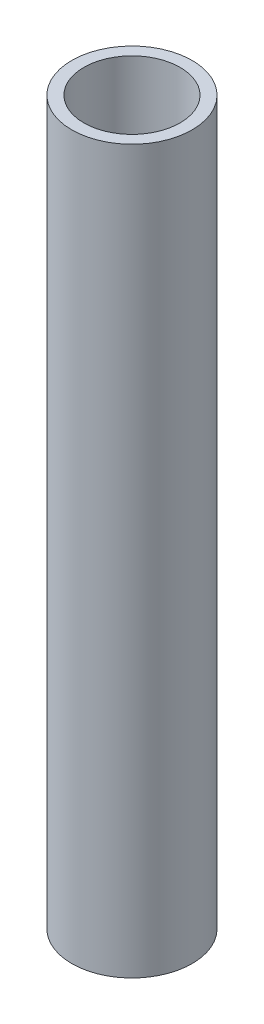
ISO-10303-21;
HEADER;
FILE_DESCRIPTION(('STEP AP214'),'2;1');
FILE_NAME('part.step','',(''),(''),'','','');
FILE_SCHEMA(('AUTOMOTIVE_DESIGN { 1 0 10303 214 1 1 1 1 }'));
ENDSEC;
DATA;
#1=APPLICATION_CONTEXT('core data for automotive mechanical design processes');
#2=APPLICATION_PROTOCOL_DEFINITION('international standard','automotive_design',2000,#1);
#3=PRODUCT_CONTEXT('',#1,'mechanical');
#4=PRODUCT('Part','Part','',(#3));
#5=PRODUCT_RELATED_PRODUCT_CATEGORY('part','',(#4));
#6=PRODUCT_DEFINITION_FORMATION('','',#4);
#7=PRODUCT_DEFINITION_CONTEXT('part definition',#1,'design');
#8=PRODUCT_DEFINITION('design','',#6,#7);
#9=PRODUCT_DEFINITION_SHAPE('','',#8);
#10=(LENGTH_UNIT() NAMED_UNIT(*) SI_UNIT(.MILLI.,.METRE.));
#11=(NAMED_UNIT(*) PLANE_ANGLE_UNIT() SI_UNIT($,.RADIAN.));
#12=(NAMED_UNIT(*) SI_UNIT($,.STERADIAN.) SOLID_ANGLE_UNIT());
#13=UNCERTAINTY_MEASURE_WITH_UNIT(LENGTH_MEASURE(1.E-05),#10,'distance_accuracy_value','');
#14=(GEOMETRIC_REPRESENTATION_CONTEXT(3) GLOBAL_UNCERTAINTY_ASSIGNED_CONTEXT((#13)) GLOBAL_UNIT_ASSIGNED_CONTEXT((#10,
#11,#12)) REPRESENTATION_CONTEXT('',''));
#15=CARTESIAN_POINT('',(0.,0.,0.));
#16=DIRECTION('',(0.,0.,1.));
#17=DIRECTION('',(1.,0.,0.));
#18=AXIS2_PLACEMENT_3D('',#15,#16,#17);
#19=CARTESIAN_POINT('',(30.34635,60.,-52.5614200242678));
#20=DIRECTION('',(0.,1.,0.));
#21=DIRECTION('',(0.,0.,1.));
#22=AXIS2_PLACEMENT_3D('',#19,#20,#21);
#23=PLANE('',#22);
#24=CARTESIAN_POINT('',(30.34635,60.,-52.5614200242678));
#25=DIRECTION('',(0.,1.,0.));
#26=DIRECTION('',(0.,0.,1.));
#27=AXIS2_PLACEMENT_3D('',#24,#25,#26);
#28=CIRCLE('',#27,5.);
#29=CARTESIAN_POINT('',(30.34635,60.,-47.5614200242678));
#30=VERTEX_POINT('',#29);
#31=EDGE_CURVE('E10',#30,#30,#28,.T.);
#32=ORIENTED_EDGE('',*,*,#31,.T.);
#33=EDGE_LOOP('',(#32));
#34=FACE_BOUND('',#33,.T.);
#35=CARTESIAN_POINT('',(30.34635,60.,-52.5614200242678));
#36=DIRECTION('',(0.,1.,0.));
#37=DIRECTION('',(0.,0.,1.));
#38=AXIS2_PLACEMENT_3D('',#35,#36,#37);
#39=CIRCLE('',#38,4.);
#40=CARTESIAN_POINT('',(30.34635,60.,-48.5614200242678));
#41=VERTEX_POINT('',#40);
#42=EDGE_CURVE('E56',#41,#41,#39,.T.);
#43=ORIENTED_EDGE('',*,*,#42,.F.);
#44=EDGE_LOOP('',(#43));
#45=FACE_BOUND('',#44,.T.);
#46=ADVANCED_FACE('F43',(#34,#45),#23,.T.);
#47=CARTESIAN_POINT('',(30.34635,0.,-52.5614200242678));
#48=DIRECTION('',(0.,1.,0.));
#49=DIRECTION('',(0.,0.,1.));
#50=AXIS2_PLACEMENT_3D('',#47,#48,#49);
#51=PLANE('',#50);
#52=CARTESIAN_POINT('',(30.34635,0.,-52.5614200242678));
#53=DIRECTION('',(0.,1.,0.));
#54=DIRECTION('',(0.,0.,1.));
#55=AXIS2_PLACEMENT_3D('',#52,#53,#54);
#56=CIRCLE('',#55,5.);
#57=CARTESIAN_POINT('',(30.34635,0.,-47.5614200242678));
#58=VERTEX_POINT('',#57);
#59=EDGE_CURVE('E47',#58,#58,#56,.T.);
#60=ORIENTED_EDGE('',*,*,#59,.F.);
#61=EDGE_LOOP('',(#60));
#62=FACE_BOUND('',#61,.T.);
#63=CARTESIAN_POINT('',(30.34635,0.,-52.5614200242678));
#64=DIRECTION('',(0.,1.,0.));
#65=DIRECTION('',(0.,0.,1.));
#66=AXIS2_PLACEMENT_3D('',#63,#64,#65);
#67=CIRCLE('',#66,4.);
#68=CARTESIAN_POINT('',(30.34635,0.,-48.5614200242678));
#69=VERTEX_POINT('',#68);
#70=EDGE_CURVE('E58',#69,#69,#67,.T.);
#71=ORIENTED_EDGE('',*,*,#70,.T.);
#72=EDGE_LOOP('',(#71));
#73=FACE_BOUND('',#72,.T.);
#74=ADVANCED_FACE('F70',(#62,#73),#51,.F.);
#75=CARTESIAN_POINT('',(30.34635,60.,-52.5614200242678));
#76=DIRECTION('',(0.,-1.,0.));
#77=DIRECTION('',(0.,0.,-1.));
#78=AXIS2_PLACEMENT_3D('',#75,#76,#77);
#79=CYLINDRICAL_SURFACE('',#78,5.);
#80=ORIENTED_EDGE('',*,*,#31,.F.);
#81=EDGE_LOOP('',(#80));
#82=FACE_BOUND('',#81,.T.);
#83=ORIENTED_EDGE('',*,*,#59,.T.);
#84=EDGE_LOOP('',(#83));
#85=FACE_BOUND('',#84,.T.);
#86=ADVANCED_FACE('F45',(#82,#85),#79,.T.);
#87=CARTESIAN_POINT('',(30.34635,60.,-52.5614200242678));
#88=DIRECTION('',(0.,-1.,0.));
#89=DIRECTION('',(0.,0.,-1.));
#90=AXIS2_PLACEMENT_3D('',#87,#88,#89);
#91=CYLINDRICAL_SURFACE('',#90,4.);
#92=ORIENTED_EDGE('',*,*,#42,.T.);
#93=EDGE_LOOP('',(#92));
#94=FACE_BOUND('',#93,.T.);
#95=ORIENTED_EDGE('',*,*,#70,.F.);
#96=EDGE_LOOP('',(#95));
#97=FACE_BOUND('',#96,.T.);
#98=ADVANCED_FACE('F66',(#94,#97),#91,.F.);
#99=CLOSED_SHELL('',(#46,#74,#86,#98));
#100=MANIFOLD_SOLID_BREP('B2',#99);
#101=ADVANCED_BREP_SHAPE_REPRESENTATION('',(#18,#100),#14);
#102=SHAPE_DEFINITION_REPRESENTATION(#9,#101);
ENDSEC;
END-ISO-10303-21;
